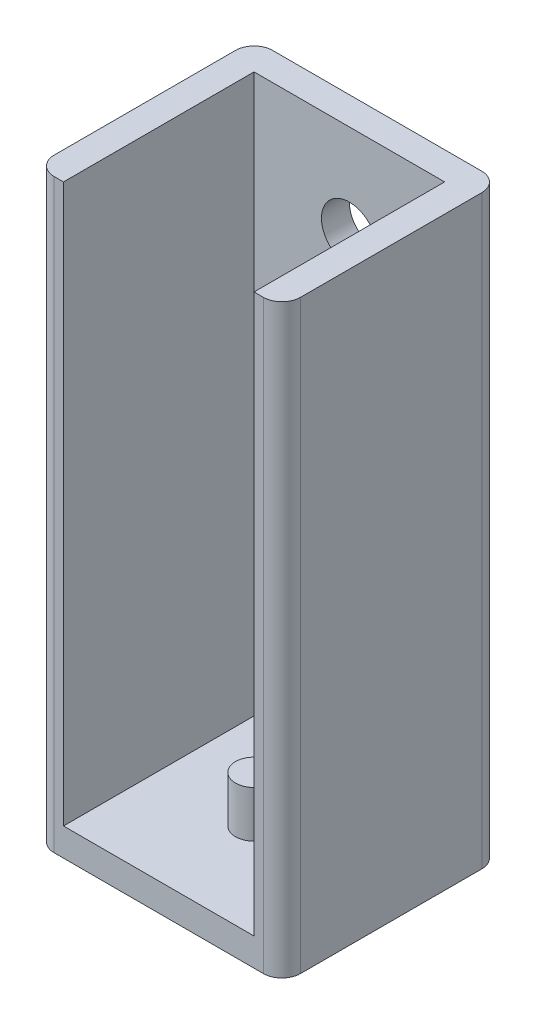
ISO-10303-21;
HEADER;
FILE_DESCRIPTION(('STEP AP214'),'2;1');
FILE_NAME('part.step','',(''),(''),'','','');
FILE_SCHEMA(('AUTOMOTIVE_DESIGN { 1 0 10303 214 1 1 1 1 }'));
ENDSEC;
DATA;
#1=APPLICATION_CONTEXT('core data for automotive mechanical design processes');
#2=APPLICATION_PROTOCOL_DEFINITION('international standard','automotive_design',2000,#1);
#3=PRODUCT_CONTEXT('',#1,'mechanical');
#4=PRODUCT('Part','Part','',(#3));
#5=PRODUCT_RELATED_PRODUCT_CATEGORY('part','',(#4));
#6=PRODUCT_DEFINITION_FORMATION('','',#4);
#7=PRODUCT_DEFINITION_CONTEXT('part definition',#1,'design');
#8=PRODUCT_DEFINITION('design','',#6,#7);
#9=PRODUCT_DEFINITION_SHAPE('','',#8);
#10=(LENGTH_UNIT() NAMED_UNIT(*) SI_UNIT(.MILLI.,.METRE.));
#11=(NAMED_UNIT(*) PLANE_ANGLE_UNIT() SI_UNIT($,.RADIAN.));
#12=(NAMED_UNIT(*) SI_UNIT($,.STERADIAN.) SOLID_ANGLE_UNIT());
#13=UNCERTAINTY_MEASURE_WITH_UNIT(LENGTH_MEASURE(1.E-05),#10,'distance_accuracy_value','');
#14=(GEOMETRIC_REPRESENTATION_CONTEXT(3) GLOBAL_UNCERTAINTY_ASSIGNED_CONTEXT((#13)) GLOBAL_UNIT_ASSIGNED_CONTEXT((#10,
#11,#12)) REPRESENTATION_CONTEXT('',''));
#15=CARTESIAN_POINT('',(0.,0.,0.));
#16=DIRECTION('',(0.,0.,1.));
#17=DIRECTION('',(1.,0.,0.));
#18=AXIS2_PLACEMENT_3D('',#15,#16,#17);
#19=CARTESIAN_POINT('',(-13.25,60.,0.));
#20=DIRECTION('',(-1.,0.,0.));
#21=DIRECTION('',(0.,0.,1.));
#22=AXIS2_PLACEMENT_3D('',#19,#20,#21);
#23=PLANE('',#22);
#24=DIRECTION('',(0.,-1.,0.));
#25=VECTOR('',#24,1.);
#26=CARTESIAN_POINT('',(-13.25,60.,-11.25));
#27=LINE('',#26,#25);
#28=CARTESIAN_POINT('',(-13.25,60.,-11.25));
#29=VERTEX_POINT('',#28);
#30=CARTESIAN_POINT('',(-13.25,-3.,-11.25));
#31=VERTEX_POINT('',#30);
#32=EDGE_CURVE('E54',#29,#31,#27,.T.);
#33=ORIENTED_EDGE('',*,*,#32,.T.);
#34=DIRECTION('',(0.,0.,-1.));
#35=VECTOR('',#34,1.);
#36=CARTESIAN_POINT('',(-13.25,-3.,0.));
#37=LINE('',#36,#35);
#38=CARTESIAN_POINT('',(-13.25,-3.,8.24999999999999));
#39=VERTEX_POINT('',#38);
#40=EDGE_CURVE('E133',#39,#31,#37,.T.);
#41=ORIENTED_EDGE('',*,*,#40,.F.);
#42=DIRECTION('',(0.,-1.,0.));
#43=VECTOR('',#42,1.);
#44=CARTESIAN_POINT('',(-13.25,60.,8.24999999999999));
#45=LINE('',#44,#43);
#46=CARTESIAN_POINT('',(-13.25,60.,8.24999999999999));
#47=VERTEX_POINT('',#46);
#48=EDGE_CURVE('E47',#47,#39,#45,.T.);
#49=ORIENTED_EDGE('',*,*,#48,.F.);
#50=DIRECTION('',(0.,0.,-1.));
#51=VECTOR('',#50,1.);
#52=CARTESIAN_POINT('',(-13.25,60.,0.));
#53=LINE('',#52,#51);
#54=EDGE_CURVE('E165',#47,#29,#53,.T.);
#55=ORIENTED_EDGE('',*,*,#54,.T.);
#56=EDGE_LOOP('',(#33,#41,#49,#55));
#57=FACE_BOUND('',#56,.T.);
#58=ADVANCED_FACE('F39',(#57),#23,.T.);
#59=CARTESIAN_POINT('',(-11.25,60.,8.25));
#60=DIRECTION('',(0.,-1.,0.));
#61=DIRECTION('',(0.,0.,-1.));
#62=AXIS2_PLACEMENT_3D('',#59,#60,#61);
#63=CYLINDRICAL_SURFACE('',#62,2.);
#64=ORIENTED_EDGE('',*,*,#48,.T.);
#65=CARTESIAN_POINT('',(-11.25,-3.,8.25));
#66=DIRECTION('',(0.,-1.,0.));
#67=DIRECTION('',(0.,0.,-1.));
#68=AXIS2_PLACEMENT_3D('',#65,#66,#67);
#69=CIRCLE('',#68,2.);
#70=CARTESIAN_POINT('',(-11.25,-3.,10.25));
#71=VERTEX_POINT('',#70);
#72=EDGE_CURVE('E127',#71,#39,#69,.T.);
#73=ORIENTED_EDGE('',*,*,#72,.F.);
#74=DIRECTION('',(0.,-1.,0.));
#75=VECTOR('',#74,1.);
#76=CARTESIAN_POINT('',(-11.25,60.,10.25));
#77=LINE('',#76,#75);
#78=CARTESIAN_POINT('',(-11.25,60.,10.25));
#79=VERTEX_POINT('',#78);
#80=EDGE_CURVE('E131',#79,#71,#77,.T.);
#81=ORIENTED_EDGE('',*,*,#80,.F.);
#82=CARTESIAN_POINT('',(-11.25,60.,8.25));
#83=DIRECTION('',(0.,1.,0.));
#84=DIRECTION('',(0.,0.,1.));
#85=AXIS2_PLACEMENT_3D('',#82,#83,#84);
#86=CIRCLE('',#85,2.);
#87=EDGE_CURVE('E128',#47,#79,#86,.T.);
#88=ORIENTED_EDGE('',*,*,#87,.F.);
#89=EDGE_LOOP('',(#64,#73,#81,#88));
#90=FACE_BOUND('',#89,.T.);
#91=ADVANCED_FACE('F124',(#90),#63,.T.);
#92=CARTESIAN_POINT('',(-10.25,60.,0.));
#93=DIRECTION('',(-1.,0.,0.));
#94=DIRECTION('',(0.,0.,1.));
#95=AXIS2_PLACEMENT_3D('',#92,#93,#94);
#96=PLANE('',#95);
#97=DIRECTION('',(0.,0.,-1.));
#98=VECTOR('',#97,1.);
#99=CARTESIAN_POINT('',(-10.25,0.,0.));
#100=LINE('',#99,#98);
#101=CARTESIAN_POINT('',(-10.25,0.,10.25));
#102=VERTEX_POINT('',#101);
#103=CARTESIAN_POINT('',(-10.25,0.,-10.25));
#104=VERTEX_POINT('',#103);
#105=EDGE_CURVE('E163',#102,#104,#100,.T.);
#106=ORIENTED_EDGE('',*,*,#105,.T.);
#107=DIRECTION('',(0.,-1.,0.));
#108=VECTOR('',#107,1.);
#109=CARTESIAN_POINT('',(-10.25,60.,-10.25));
#110=LINE('',#109,#108);
#111=CARTESIAN_POINT('',(-10.25,60.,-10.25));
#112=VERTEX_POINT('',#111);
#113=EDGE_CURVE('E214',#112,#104,#110,.T.);
#114=ORIENTED_EDGE('',*,*,#113,.F.);
#115=DIRECTION('',(0.,0.,-1.));
#116=VECTOR('',#115,1.);
#117=CARTESIAN_POINT('',(-10.25,60.,0.));
#118=LINE('',#117,#116);
#119=CARTESIAN_POINT('',(-10.25,60.,10.25));
#120=VERTEX_POINT('',#119);
#121=EDGE_CURVE('E171',#120,#112,#118,.T.);
#122=ORIENTED_EDGE('',*,*,#121,.F.);
#123=DIRECTION('',(0.,-1.,0.));
#124=VECTOR('',#123,1.);
#125=CARTESIAN_POINT('',(-10.25,60.,10.25));
#126=LINE('',#125,#124);
#127=EDGE_CURVE('E217',#120,#102,#126,.T.);
#128=ORIENTED_EDGE('',*,*,#127,.T.);
#129=EDGE_LOOP('',(#106,#114,#122,#128));
#130=FACE_BOUND('',#129,.T.);
#131=ADVANCED_FACE('F260',(#130),#96,.F.);
#132=CARTESIAN_POINT('',(0.,60.,-10.25));
#133=DIRECTION('',(0.,0.,-1.));
#134=DIRECTION('',(-1.,0.,0.));
#135=AXIS2_PLACEMENT_3D('',#132,#133,#134);
#136=PLANE('',#135);
#137=CARTESIAN_POINT('',(0.,50.,-10.25));
#138=DIRECTION('',(0.,0.,-1.));
#139=DIRECTION('',(-1.,0.,0.));
#140=AXIS2_PLACEMENT_3D('',#137,#138,#139);
#141=CIRCLE('',#140,3.);
#142=CARTESIAN_POINT('',(-3.,50.,-10.25));
#143=VERTEX_POINT('',#142);
#144=EDGE_CURVE('E485',#143,#143,#141,.T.);
#145=ORIENTED_EDGE('',*,*,#144,.T.);
#146=EDGE_LOOP('',(#145));
#147=FACE_BOUND('',#146,.T.);
#148=CARTESIAN_POINT('',(0.,17.,-10.25));
#149=DIRECTION('',(0.,0.,-1.));
#150=DIRECTION('',(-1.,0.,0.));
#151=AXIS2_PLACEMENT_3D('',#148,#149,#150);
#152=CIRCLE('',#151,3.);
#153=CARTESIAN_POINT('',(-3.00000000000001,17.,-10.25));
#154=VERTEX_POINT('',#153);
#155=EDGE_CURVE('E486',#154,#154,#152,.T.);
#156=ORIENTED_EDGE('',*,*,#155,.T.);
#157=EDGE_LOOP('',(#156));
#158=FACE_BOUND('',#157,.T.);
#159=DIRECTION('',(1.,0.,0.));
#160=VECTOR('',#159,1.);
#161=CARTESIAN_POINT('',(0.,0.,-10.25));
#162=LINE('',#161,#160);
#163=CARTESIAN_POINT('',(10.25,0.,-10.25));
#164=VERTEX_POINT('',#163);
#165=EDGE_CURVE('E193',#104,#164,#162,.T.);
#166=ORIENTED_EDGE('',*,*,#165,.T.);
#167=DIRECTION('',(0.,-1.,0.));
#168=VECTOR('',#167,1.);
#169=CARTESIAN_POINT('',(10.25,60.,-10.25));
#170=LINE('',#169,#168);
#171=CARTESIAN_POINT('',(10.25,60.,-10.25));
#172=VERTEX_POINT('',#171);
#173=EDGE_CURVE('E211',#172,#164,#170,.T.);
#174=ORIENTED_EDGE('',*,*,#173,.F.);
#175=DIRECTION('',(1.,0.,0.));
#176=VECTOR('',#175,1.);
#177=CARTESIAN_POINT('',(0.,60.,-10.25));
#178=LINE('',#177,#176);
#179=EDGE_CURVE('E174',#112,#172,#178,.T.);
#180=ORIENTED_EDGE('',*,*,#179,.F.);
#181=ORIENTED_EDGE('',*,*,#113,.T.);
#182=EDGE_LOOP('',(#166,#174,#180,#181));
#183=FACE_BOUND('',#182,.T.);
#184=ADVANCED_FACE('F262',(#147,#158,#183),#136,.F.);
#185=CARTESIAN_POINT('',(10.25,60.,0.));
#186=DIRECTION('',(-1.,0.,0.));
#187=DIRECTION('',(0.,0.,1.));
#188=AXIS2_PLACEMENT_3D('',#185,#186,#187);
#189=PLANE('',#188);
#190=DIRECTION('',(0.,0.,-1.));
#191=VECTOR('',#190,1.);
#192=CARTESIAN_POINT('',(10.25,0.,0.));
#193=LINE('',#192,#191);
#194=CARTESIAN_POINT('',(10.25,0.,10.25));
#195=VERTEX_POINT('',#194);
#196=EDGE_CURVE('E167',#195,#164,#193,.T.);
#197=ORIENTED_EDGE('',*,*,#196,.F.);
#198=DIRECTION('',(0.,-1.,0.));
#199=VECTOR('',#198,1.);
#200=CARTESIAN_POINT('',(10.25,60.,10.25));
#201=LINE('',#200,#199);
#202=CARTESIAN_POINT('',(10.25,60.,10.25));
#203=VERTEX_POINT('',#202);
#204=EDGE_CURVE('E208',#203,#195,#201,.T.);
#205=ORIENTED_EDGE('',*,*,#204,.F.);
#206=DIRECTION('',(0.,0.,-1.));
#207=VECTOR('',#206,1.);
#208=CARTESIAN_POINT('',(10.25,60.,0.));
#209=LINE('',#208,#207);
#210=EDGE_CURVE('E176',#203,#172,#209,.T.);
#211=ORIENTED_EDGE('',*,*,#210,.T.);
#212=ORIENTED_EDGE('',*,*,#173,.T.);
#213=EDGE_LOOP('',(#197,#205,#211,#212));
#214=FACE_BOUND('',#213,.T.);
#215=ADVANCED_FACE('F255',(#214),#189,.T.);
#216=CARTESIAN_POINT('',(0.,60.,10.25));
#217=DIRECTION('',(0.,0.,-1.));
#218=DIRECTION('',(-1.,0.,0.));
#219=AXIS2_PLACEMENT_3D('',#216,#217,#218);
#220=PLANE('',#219);
#221=ORIENTED_EDGE('',*,*,#204,.T.);
#222=DIRECTION('',(-1.,0.,0.));
#223=VECTOR('',#222,1.);
#224=CARTESIAN_POINT('',(0.,0.,10.25));
#225=LINE('',#224,#223);
#226=EDGE_CURVE('E143',#195,#102,#225,.T.);
#227=ORIENTED_EDGE('',*,*,#226,.T.);
#228=ORIENTED_EDGE('',*,*,#127,.F.);
#229=DIRECTION('',(1.,0.,0.));
#230=VECTOR('',#229,1.);
#231=CARTESIAN_POINT('',(0.,60.,10.25));
#232=LINE('',#231,#230);
#233=EDGE_CURVE('E169',#79,#120,#232,.T.);
#234=ORIENTED_EDGE('',*,*,#233,.F.);
#235=ORIENTED_EDGE('',*,*,#80,.T.);
#236=DIRECTION('',(-1.,0.,0.));
#237=VECTOR('',#236,1.);
#238=CARTESIAN_POINT('',(0.,-3.,10.25));
#239=LINE('',#238,#237);
#240=CARTESIAN_POINT('',(11.25,-3.,10.25));
#241=VERTEX_POINT('',#240);
#242=EDGE_CURVE('E142',#241,#71,#239,.T.);
#243=ORIENTED_EDGE('',*,*,#242,.F.);
#244=DIRECTION('',(0.,-1.,0.));
#245=VECTOR('',#244,1.);
#246=CARTESIAN_POINT('',(11.25,60.,10.25));
#247=LINE('',#246,#245);
#248=CARTESIAN_POINT('',(11.25,60.,10.25));
#249=VERTEX_POINT('',#248);
#250=EDGE_CURVE('E206',#249,#241,#247,.T.);
#251=ORIENTED_EDGE('',*,*,#250,.F.);
#252=EDGE_CURVE('E172',#203,#249,#232,.T.);
#253=ORIENTED_EDGE('',*,*,#252,.F.);
#254=EDGE_LOOP('',(#221,#227,#228,#234,#235,#243,#251,#253));
#255=FACE_BOUND('',#254,.T.);
#256=ADVANCED_FACE('F222',(#255),#220,.F.);
#257=CARTESIAN_POINT('',(11.25,60.,8.25));
#258=DIRECTION('',(0.,-1.,0.));
#259=DIRECTION('',(0.,0.,-1.));
#260=AXIS2_PLACEMENT_3D('',#257,#258,#259);
#261=CYLINDRICAL_SURFACE('',#260,2.);
#262=ORIENTED_EDGE('',*,*,#250,.T.);
#263=CARTESIAN_POINT('',(11.25,-3.,8.25));
#264=DIRECTION('',(0.,-1.,0.));
#265=DIRECTION('',(0.,0.,-1.));
#266=AXIS2_PLACEMENT_3D('',#263,#264,#265);
#267=CIRCLE('',#266,2.);
#268=CARTESIAN_POINT('',(13.25,-3.,8.24999999999999));
#269=VERTEX_POINT('',#268);
#270=EDGE_CURVE('E161',#269,#241,#267,.T.);
#271=ORIENTED_EDGE('',*,*,#270,.F.);
#272=DIRECTION('',(0.,-1.,0.));
#273=VECTOR('',#272,1.);
#274=CARTESIAN_POINT('',(13.25,60.,8.24999999999999));
#275=LINE('',#274,#273);
#276=CARTESIAN_POINT('',(13.25,60.,8.24999999999999));
#277=VERTEX_POINT('',#276);
#278=EDGE_CURVE('E204',#277,#269,#275,.T.);
#279=ORIENTED_EDGE('',*,*,#278,.F.);
#280=CARTESIAN_POINT('',(11.25,60.,8.25));
#281=DIRECTION('',(0.,1.,0.));
#282=DIRECTION('',(0.,0.,1.));
#283=AXIS2_PLACEMENT_3D('',#280,#281,#282);
#284=CIRCLE('',#283,2.);
#285=EDGE_CURVE('E179',#249,#277,#284,.T.);
#286=ORIENTED_EDGE('',*,*,#285,.F.);
#287=EDGE_LOOP('',(#262,#271,#279,#286));
#288=FACE_BOUND('',#287,.T.);
#289=ADVANCED_FACE('F248',(#288),#261,.T.);
#290=CARTESIAN_POINT('',(13.25,60.,0.));
#291=DIRECTION('',(-1.,0.,0.));
#292=DIRECTION('',(0.,0.,1.));
#293=AXIS2_PLACEMENT_3D('',#290,#291,#292);
#294=PLANE('',#293);
#295=ORIENTED_EDGE('',*,*,#278,.T.);
#296=DIRECTION('',(0.,0.,1.));
#297=VECTOR('',#296,1.);
#298=CARTESIAN_POINT('',(13.25,-3.,0.));
#299=LINE('',#298,#297);
#300=CARTESIAN_POINT('',(13.25,-3.,-11.25));
#301=VERTEX_POINT('',#300);
#302=EDGE_CURVE('E158',#301,#269,#299,.T.);
#303=ORIENTED_EDGE('',*,*,#302,.F.);
#304=DIRECTION('',(0.,-1.,0.));
#305=VECTOR('',#304,1.);
#306=CARTESIAN_POINT('',(13.25,60.,-11.25));
#307=LINE('',#306,#305);
#308=CARTESIAN_POINT('',(13.25,60.,-11.25));
#309=VERTEX_POINT('',#308);
#310=EDGE_CURVE('E202',#309,#301,#307,.T.);
#311=ORIENTED_EDGE('',*,*,#310,.F.);
#312=DIRECTION('',(0.,0.,-1.));
#313=VECTOR('',#312,1.);
#314=CARTESIAN_POINT('',(13.25,60.,0.));
#315=LINE('',#314,#313);
#316=EDGE_CURVE('E181',#277,#309,#315,.T.);
#317=ORIENTED_EDGE('',*,*,#316,.F.);
#318=EDGE_LOOP('',(#295,#303,#311,#317));
#319=FACE_BOUND('',#318,.T.);
#320=ADVANCED_FACE('F245',(#319),#294,.F.);
#321=CARTESIAN_POINT('',(11.25,60.,-11.25));
#322=DIRECTION('',(0.,-1.,0.));
#323=DIRECTION('',(0.,0.,-1.));
#324=AXIS2_PLACEMENT_3D('',#321,#322,#323);
#325=CYLINDRICAL_SURFACE('',#324,2.);
#326=ORIENTED_EDGE('',*,*,#310,.T.);
#327=CARTESIAN_POINT('',(11.25,-3.,-11.25));
#328=DIRECTION('',(0.,-1.,0.));
#329=DIRECTION('',(0.,0.,-1.));
#330=AXIS2_PLACEMENT_3D('',#327,#328,#329);
#331=CIRCLE('',#330,2.);
#332=CARTESIAN_POINT('',(11.25,-3.,-13.25));
#333=VERTEX_POINT('',#332);
#334=EDGE_CURVE('E155',#333,#301,#331,.T.);
#335=ORIENTED_EDGE('',*,*,#334,.F.);
#336=DIRECTION('',(0.,-1.,0.));
#337=VECTOR('',#336,1.);
#338=CARTESIAN_POINT('',(11.25,60.,-13.25));
#339=LINE('',#338,#337);
#340=CARTESIAN_POINT('',(11.25,60.,-13.25));
#341=VERTEX_POINT('',#340);
#342=EDGE_CURVE('E200',#341,#333,#339,.T.);
#343=ORIENTED_EDGE('',*,*,#342,.F.);
#344=CARTESIAN_POINT('',(11.25,60.,-11.25));
#345=DIRECTION('',(0.,1.,0.));
#346=DIRECTION('',(0.,0.,1.));
#347=AXIS2_PLACEMENT_3D('',#344,#345,#346);
#348=CIRCLE('',#347,2.);
#349=EDGE_CURVE('E183',#341,#309,#348,.F.);
#350=ORIENTED_EDGE('',*,*,#349,.T.);
#351=EDGE_LOOP('',(#326,#335,#343,#350));
#352=FACE_BOUND('',#351,.T.);
#353=ADVANCED_FACE('F238',(#352),#325,.T.);
#354=CARTESIAN_POINT('',(0.,60.,-13.25));
#355=DIRECTION('',(0.,0.,-1.));
#356=DIRECTION('',(-1.,0.,0.));
#357=AXIS2_PLACEMENT_3D('',#354,#355,#356);
#358=PLANE('',#357);
#359=CARTESIAN_POINT('',(0.,50.,-13.25));
#360=DIRECTION('',(0.,0.,-1.));
#361=DIRECTION('',(-1.,0.,0.));
#362=AXIS2_PLACEMENT_3D('',#359,#360,#361);
#363=CIRCLE('',#362,3.);
#364=CARTESIAN_POINT('',(-3.,50.,-13.25));
#365=VERTEX_POINT('',#364);
#366=EDGE_CURVE('E483',#365,#365,#363,.T.);
#367=ORIENTED_EDGE('',*,*,#366,.F.);
#368=EDGE_LOOP('',(#367));
#369=FACE_BOUND('',#368,.T.);
#370=CARTESIAN_POINT('',(0.,17.,-13.25));
#371=DIRECTION('',(0.,0.,-1.));
#372=DIRECTION('',(-1.,0.,0.));
#373=AXIS2_PLACEMENT_3D('',#370,#371,#372);
#374=CIRCLE('',#373,3.);
#375=CARTESIAN_POINT('',(-3.00000000000001,17.,-13.25));
#376=VERTEX_POINT('',#375);
#377=EDGE_CURVE('E491',#376,#376,#374,.T.);
#378=ORIENTED_EDGE('',*,*,#377,.F.);
#379=EDGE_LOOP('',(#378));
#380=FACE_BOUND('',#379,.T.);
#381=ORIENTED_EDGE('',*,*,#342,.T.);
#382=DIRECTION('',(1.,0.,0.));
#383=VECTOR('',#382,1.);
#384=CARTESIAN_POINT('',(0.,-3.,-13.25));
#385=LINE('',#384,#383);
#386=CARTESIAN_POINT('',(-11.25,-3.,-13.25));
#387=VERTEX_POINT('',#386);
#388=EDGE_CURVE('E152',#387,#333,#385,.T.);
#389=ORIENTED_EDGE('',*,*,#388,.F.);
#390=DIRECTION('',(0.,-1.,0.));
#391=VECTOR('',#390,1.);
#392=CARTESIAN_POINT('',(-11.25,60.,-13.25));
#393=LINE('',#392,#391);
#394=CARTESIAN_POINT('',(-11.25,60.,-13.25));
#395=VERTEX_POINT('',#394);
#396=EDGE_CURVE('E198',#395,#387,#393,.T.);
#397=ORIENTED_EDGE('',*,*,#396,.F.);
#398=DIRECTION('',(1.,0.,0.));
#399=VECTOR('',#398,1.);
#400=CARTESIAN_POINT('',(0.,60.,-13.25));
#401=LINE('',#400,#399);
#402=EDGE_CURVE('E186',#395,#341,#401,.T.);
#403=ORIENTED_EDGE('',*,*,#402,.T.);
#404=EDGE_LOOP('',(#381,#389,#397,#403));
#405=FACE_BOUND('',#404,.T.);
#406=ADVANCED_FACE('F236',(#369,#380,#405),#358,.T.);
#407=CARTESIAN_POINT('',(-11.25,60.,-11.25));
#408=DIRECTION('',(0.,-1.,0.));
#409=DIRECTION('',(0.,0.,-1.));
#410=AXIS2_PLACEMENT_3D('',#407,#408,#409);
#411=CYLINDRICAL_SURFACE('',#410,2.);
#412=ORIENTED_EDGE('',*,*,#396,.T.);
#413=CARTESIAN_POINT('',(-11.25,-3.,-11.25));
#414=DIRECTION('',(0.,-1.,0.));
#415=DIRECTION('',(0.,0.,-1.));
#416=AXIS2_PLACEMENT_3D('',#413,#414,#415);
#417=CIRCLE('',#416,2.);
#418=EDGE_CURVE('E136',#31,#387,#417,.T.);
#419=ORIENTED_EDGE('',*,*,#418,.F.);
#420=ORIENTED_EDGE('',*,*,#32,.F.);
#421=CARTESIAN_POINT('',(-11.25,60.,-11.25));
#422=DIRECTION('',(0.,1.,0.));
#423=DIRECTION('',(0.,0.,1.));
#424=AXIS2_PLACEMENT_3D('',#421,#422,#423);
#425=CIRCLE('',#424,2.);
#426=EDGE_CURVE('E189',#29,#395,#425,.F.);
#427=ORIENTED_EDGE('',*,*,#426,.T.);
#428=EDGE_LOOP('',(#412,#419,#420,#427));
#429=FACE_BOUND('',#428,.T.);
#430=ADVANCED_FACE('F232',(#429),#411,.T.);
#431=CARTESIAN_POINT('',(0.,60.,0.));
#432=DIRECTION('',(0.,1.,0.));
#433=DIRECTION('',(0.,0.,1.));
#434=AXIS2_PLACEMENT_3D('',#431,#432,#433);
#435=PLANE('',#434);
#436=ORIENTED_EDGE('',*,*,#54,.F.);
#437=ORIENTED_EDGE('',*,*,#87,.T.);
#438=ORIENTED_EDGE('',*,*,#233,.T.);
#439=ORIENTED_EDGE('',*,*,#121,.T.);
#440=ORIENTED_EDGE('',*,*,#179,.T.);
#441=ORIENTED_EDGE('',*,*,#210,.F.);
#442=ORIENTED_EDGE('',*,*,#252,.T.);
#443=ORIENTED_EDGE('',*,*,#285,.T.);
#444=ORIENTED_EDGE('',*,*,#316,.T.);
#445=ORIENTED_EDGE('',*,*,#349,.F.);
#446=ORIENTED_EDGE('',*,*,#402,.F.);
#447=ORIENTED_EDGE('',*,*,#426,.F.);
#448=EDGE_LOOP('',(#436,#437,#438,#439,#440,#441,#442,#443,#444,#445,#446,#447));
#449=FACE_BOUND('',#448,.T.);
#450=ADVANCED_FACE('F227',(#449),#435,.T.);
#451=CARTESIAN_POINT('',(0.,0.,0.));
#452=DIRECTION('',(0.,-1.,0.));
#453=DIRECTION('',(0.,0.,-1.));
#454=AXIS2_PLACEMENT_3D('',#451,#452,#453);
#455=PLANE('',#454);
#456=CARTESIAN_POINT('',(0.,0.,0.));
#457=DIRECTION('',(0.,-1.,0.));
#458=DIRECTION('',(0.,0.,-1.));
#459=AXIS2_PLACEMENT_3D('',#456,#457,#458);
#460=CIRCLE('',#459,2.);
#461=CARTESIAN_POINT('',(0.,0.,-2.));
#462=VERTEX_POINT('',#461);
#463=EDGE_CURVE('E11',#462,#462,#460,.F.);
#464=ORIENTED_EDGE('',*,*,#463,.F.);
#465=EDGE_LOOP('',(#464));
#466=FACE_BOUND('',#465,.T.);
#467=ORIENTED_EDGE('',*,*,#226,.F.);
#468=ORIENTED_EDGE('',*,*,#196,.T.);
#469=ORIENTED_EDGE('',*,*,#165,.F.);
#470=ORIENTED_EDGE('',*,*,#105,.F.);
#471=EDGE_LOOP('',(#467,#468,#469,#470));
#472=FACE_BOUND('',#471,.T.);
#473=ADVANCED_FACE('F258',(#466,#472),#455,.F.);
#474=CARTESIAN_POINT('',(0.,-3.,0.));
#475=DIRECTION('',(0.,-1.,0.));
#476=DIRECTION('',(0.,0.,-1.));
#477=AXIS2_PLACEMENT_3D('',#474,#475,#476);
#478=PLANE('',#477);
#479=ORIENTED_EDGE('',*,*,#72,.T.);
#480=ORIENTED_EDGE('',*,*,#40,.T.);
#481=ORIENTED_EDGE('',*,*,#418,.T.);
#482=ORIENTED_EDGE('',*,*,#388,.T.);
#483=ORIENTED_EDGE('',*,*,#334,.T.);
#484=ORIENTED_EDGE('',*,*,#302,.T.);
#485=ORIENTED_EDGE('',*,*,#270,.T.);
#486=ORIENTED_EDGE('',*,*,#242,.T.);
#487=EDGE_LOOP('',(#479,#480,#481,#482,#483,#484,#485,#486));
#488=FACE_BOUND('',#487,.T.);
#489=ADVANCED_FACE('F139',(#488),#478,.T.);
#490=CARTESIAN_POINT('',(0.,5.,0.));
#491=DIRECTION('',(0.,-1.,0.));
#492=DIRECTION('',(0.,0.,-1.));
#493=AXIS2_PLACEMENT_3D('',#490,#491,#492);
#494=CYLINDRICAL_SURFACE('',#493,2.);
#495=CARTESIAN_POINT('',(0.,5.,0.));
#496=DIRECTION('',(0.,1.,0.));
#497=DIRECTION('',(0.,0.,1.));
#498=AXIS2_PLACEMENT_3D('',#495,#496,#497);
#499=CIRCLE('',#498,2.);
#500=CARTESIAN_POINT('',(0.,5.,2.));
#501=VERTEX_POINT('',#500);
#502=EDGE_CURVE('E146',#501,#501,#499,.T.);
#503=ORIENTED_EDGE('',*,*,#502,.F.);
#504=EDGE_LOOP('',(#503));
#505=FACE_BOUND('',#504,.T.);
#506=ORIENTED_EDGE('',*,*,#463,.T.);
#507=EDGE_LOOP('',(#506));
#508=FACE_BOUND('',#507,.T.);
#509=ADVANCED_FACE('F351',(#505,#508),#494,.T.);
#510=CARTESIAN_POINT('',(0.,5.,0.));
#511=DIRECTION('',(0.,1.,0.));
#512=DIRECTION('',(0.,0.,1.));
#513=AXIS2_PLACEMENT_3D('',#510,#511,#512);
#514=PLANE('',#513);
#515=ORIENTED_EDGE('',*,*,#502,.T.);
#516=EDGE_LOOP('',(#515));
#517=FACE_BOUND('',#516,.T.);
#518=ADVANCED_FACE('F370',(#517),#514,.T.);
#519=CARTESIAN_POINT('',(0.,17.,18.7352813742386));
#520=DIRECTION('',(0.,0.,-1.));
#521=DIRECTION('',(-1.,0.,0.));
#522=AXIS2_PLACEMENT_3D('',#519,#520,#521);
#523=CYLINDRICAL_SURFACE('',#522,3.);
#524=ORIENTED_EDGE('',*,*,#377,.T.);
#525=EDGE_LOOP('',(#524));
#526=FACE_BOUND('',#525,.T.);
#527=ORIENTED_EDGE('',*,*,#155,.F.);
#528=EDGE_LOOP('',(#527));
#529=FACE_BOUND('',#528,.T.);
#530=ADVANCED_FACE('F379',(#526,#529),#523,.F.);
#531=CARTESIAN_POINT('',(0.,50.,18.7352813742386));
#532=DIRECTION('',(0.,0.,-1.));
#533=DIRECTION('',(-1.,0.,0.));
#534=AXIS2_PLACEMENT_3D('',#531,#532,#533);
#535=CYLINDRICAL_SURFACE('',#534,3.);
#536=ORIENTED_EDGE('',*,*,#366,.T.);
#537=EDGE_LOOP('',(#536));
#538=FACE_BOUND('',#537,.T.);
#539=ORIENTED_EDGE('',*,*,#144,.F.);
#540=EDGE_LOOP('',(#539));
#541=FACE_BOUND('',#540,.T.);
#542=ADVANCED_FACE('F401',(#538,#541),#535,.F.);
#543=CLOSED_SHELL('',(#58,#91,#131,#184,#215,#256,#289,#320,#353,#406,#430,#450,#473,#489,#509,
#518,#530,#542));
#544=MANIFOLD_SOLID_BREP('B2',#543);
#545=ADVANCED_BREP_SHAPE_REPRESENTATION('',(#18,#544),#14);
#546=SHAPE_DEFINITION_REPRESENTATION(#9,#545);
ENDSEC;
END-ISO-10303-21;
